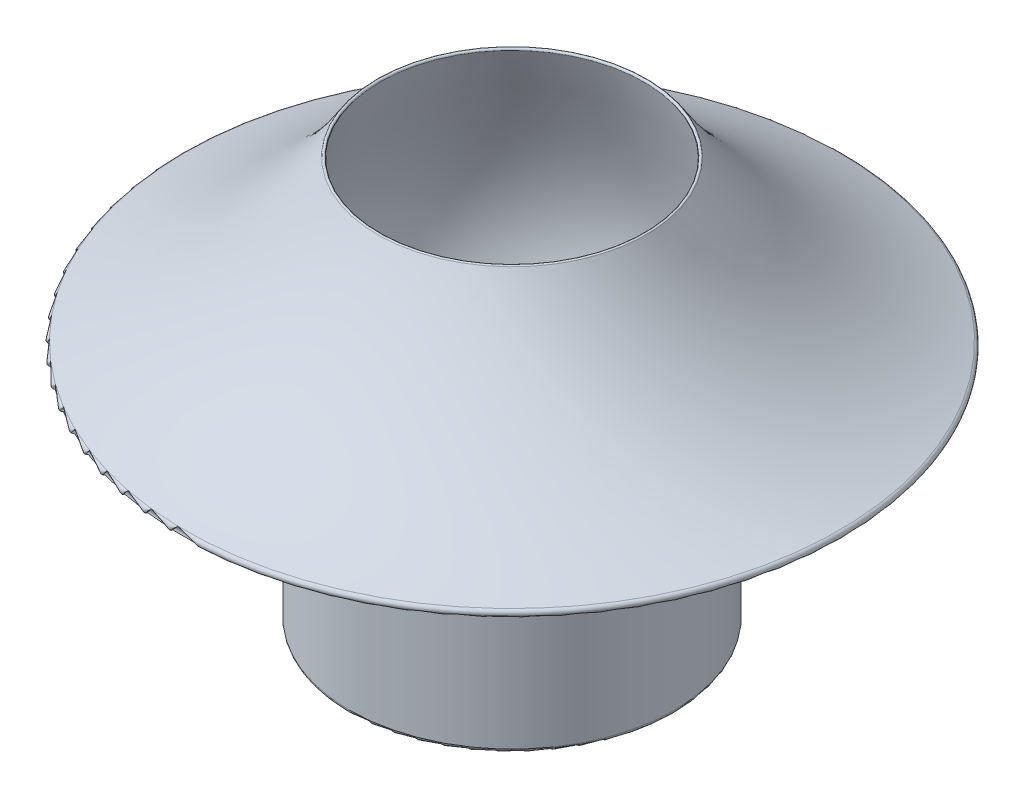
ISO-10303-21;
HEADER;
FILE_DESCRIPTION(('STEP AP214'),'2;1');
FILE_NAME('part.step','',(''),(''),'','','');
FILE_SCHEMA(('AUTOMOTIVE_DESIGN { 1 0 10303 214 1 1 1 1 }'));
ENDSEC;
DATA;
#1=APPLICATION_CONTEXT('core data for automotive mechanical design processes');
#2=APPLICATION_PROTOCOL_DEFINITION('international standard','automotive_design',2000,#1);
#3=PRODUCT_CONTEXT('',#1,'mechanical');
#4=PRODUCT('Part','Part','',(#3));
#5=PRODUCT_RELATED_PRODUCT_CATEGORY('part','',(#4));
#6=PRODUCT_DEFINITION_FORMATION('','',#4);
#7=PRODUCT_DEFINITION_CONTEXT('part definition',#1,'design');
#8=PRODUCT_DEFINITION('design','',#6,#7);
#9=PRODUCT_DEFINITION_SHAPE('','',#8);
#10=(LENGTH_UNIT() NAMED_UNIT(*) SI_UNIT(.MILLI.,.METRE.));
#11=(NAMED_UNIT(*) PLANE_ANGLE_UNIT() SI_UNIT($,.RADIAN.));
#12=(NAMED_UNIT(*) SI_UNIT($,.STERADIAN.) SOLID_ANGLE_UNIT());
#13=UNCERTAINTY_MEASURE_WITH_UNIT(LENGTH_MEASURE(1.E-05),#10,'distance_accuracy_value','');
#14=(GEOMETRIC_REPRESENTATION_CONTEXT(3) GLOBAL_UNCERTAINTY_ASSIGNED_CONTEXT((#13)) GLOBAL_UNIT_ASSIGNED_CONTEXT((#10,
#11,#12)) REPRESENTATION_CONTEXT('',''));
#15=CARTESIAN_POINT('',(0.,0.,0.));
#16=DIRECTION('',(0.,0.,1.));
#17=DIRECTION('',(1.,0.,0.));
#18=AXIS2_PLACEMENT_3D('',#15,#16,#17);
#19=CARTESIAN_POINT('',(-9.4,0.,0.));
#20=CARTESIAN_POINT('',(-9.33948597216466,4.84657774379016,0.));
#21=CARTESIAN_POINT('',(-9.33238520559473,5.66205795557004,0.));
#22=CARTESIAN_POINT('',(-9.3826600404896,9.93484360617857,0.));
#23=CARTESIAN_POINT('',(-12.7943838867771,16.5906599900294,0.));
#24=CARTESIAN_POINT('',(-9.68133208366127,22.7310987063358,0.));
#25=CARTESIAN_POINT('',(-8.5,27.2,0.));
#26=B_SPLINE_CURVE_WITH_KNOTS('',3,(#19,#20,#21,#22,#23,#24,#25),.UNSPECIFIED.,.F.,.F.,(4,1,1,1,
4),(0.,0.339183226100984,0.391163003284907,0.51979777183923,1.),.UNSPECIFIED.);
#27=CARTESIAN_POINT('',(0.,27.2,0.));
#28=DIRECTION('',(0.,1.,0.));
#29=AXIS1_PLACEMENT('',#27,#28);
#30=SURFACE_OF_REVOLUTION('',#26,#29);
#31=CARTESIAN_POINT('',(0.,26.4553874509103,0.));
#32=DIRECTION('',(0.,1.,0.));
#33=DIRECTION('',(-1.,0.,0.));
#34=AXIS2_PLACEMENT_3D('',#31,#32,#33);
#35=CIRCLE('',#34,8.70675476761947);
#36=CARTESIAN_POINT('',(-8.70675476761947,26.4553874509103,0.));
#37=VERTEX_POINT('',#36);
#38=EDGE_CURVE('E60',#37,#37,#35,.T.);
#39=ORIENTED_EDGE('',*,*,#38,.T.);
#40=EDGE_LOOP('',(#39));
#41=FACE_BOUND('',#40,.T.);
#42=CARTESIAN_POINT('',(0.,0.,0.));
#43=DIRECTION('',(0.,1.,0.));
#44=DIRECTION('',(-1.,0.,0.));
#45=AXIS2_PLACEMENT_3D('',#42,#43,#44);
#46=CIRCLE('',#45,9.4);
#47=CARTESIAN_POINT('',(-9.4,0.,0.));
#48=VERTEX_POINT('',#47);
#49=EDGE_CURVE('E69',#48,#48,#46,.T.);
#50=ORIENTED_EDGE('',*,*,#49,.F.);
#51=EDGE_LOOP('',(#50));
#52=FACE_BOUND('',#51,.T.);
#53=ADVANCED_FACE('F31',(#41,#52),#30,.F.);
#54=CARTESIAN_POINT('',(0.,39.5768378294714,0.));
#55=DIRECTION('',(0.,1.,0.));
#56=DIRECTION('',(-1.,0.,0.));
#57=AXIS2_PLACEMENT_3D('',#54,#55,#56);
#58=TOROIDAL_SURFACE('',#57,30.4571725934355,25.2052284844821);
#59=CARTESIAN_POINT('',(0.,15.9840073066325,0.));
#60=DIRECTION('',(0.,1.,0.));
#61=DIRECTION('',(-1.,0.,0.));
#62=AXIS2_PLACEMENT_3D('',#59,#60,#61);
#63=CIRCLE('',#62,21.5868912633113);
#64=CARTESIAN_POINT('',(-21.5868912633113,15.9840073066325,0.));
#65=VERTEX_POINT('',#64);
#66=EDGE_CURVE('E38',#65,#65,#63,.T.);
#67=ORIENTED_EDGE('',*,*,#66,.T.);
#68=EDGE_LOOP('',(#67));
#69=FACE_BOUND('',#68,.T.);
#70=CARTESIAN_POINT('',(0.,26.5349585195775,0.));
#71=DIRECTION('',(0.,1.,0.));
#72=DIRECTION('',(-1.,0.,0.));
#73=AXIS2_PLACEMENT_3D('',#70,#71,#72);
#74=CIRCLE('',#73,8.88837737856289);
#75=CARTESIAN_POINT('',(-8.88837737856289,26.5349585195775,0.));
#76=VERTEX_POINT('',#75);
#77=EDGE_CURVE('E57',#76,#76,#74,.F.);
#78=ORIENTED_EDGE('',*,*,#77,.T.);
#79=EDGE_LOOP('',(#78));
#80=FACE_BOUND('',#79,.T.);
#81=ADVANCED_FACE('F82',(#69,#80),#58,.F.);
#82=CARTESIAN_POINT('',(-14.8,15.5,0.));
#83=DIRECTION('',(0.,-1.,0.));
#84=DIRECTION('',(1.,0.,0.));
#85=AXIS2_PLACEMENT_3D('',#82,#83,#84);
#86=PLANE('',#85);
#87=CARTESIAN_POINT('',(0.,15.5,0.));
#88=DIRECTION('',(0.,-1.,0.));
#89=DIRECTION('',(1.,0.,0.));
#90=AXIS2_PLACEMENT_3D('',#87,#88,#89);
#91=CIRCLE('',#90,21.4989106947599);
#92=CARTESIAN_POINT('',(21.4989106947599,15.5,0.));
#93=VERTEX_POINT('',#92);
#94=EDGE_CURVE('E10',#93,#93,#91,.T.);
#95=ORIENTED_EDGE('',*,*,#94,.T.);
#96=EDGE_LOOP('',(#95));
#97=FACE_BOUND('',#96,.T.);
#98=CARTESIAN_POINT('',(0.,15.5,0.));
#99=DIRECTION('',(0.,1.,0.));
#100=DIRECTION('',(-1.,0.,0.));
#101=AXIS2_PLACEMENT_3D('',#98,#99,#100);
#102=CIRCLE('',#101,14.8);
#103=CARTESIAN_POINT('',(-14.8,15.5,0.));
#104=VERTEX_POINT('',#103);
#105=EDGE_CURVE('E63',#104,#104,#102,.T.);
#106=ORIENTED_EDGE('',*,*,#105,.T.);
#107=EDGE_LOOP('',(#106));
#108=FACE_BOUND('',#107,.T.);
#109=ADVANCED_FACE('F118',(#97,#108),#86,.T.);
#110=CARTESIAN_POINT('',(0.,27.2,0.));
#111=DIRECTION('',(0.,1.,0.));
#112=DIRECTION('',(-1.,0.,0.));
#113=AXIS2_PLACEMENT_3D('',#110,#111,#112);
#114=CYLINDRICAL_SURFACE('',#113,14.8);
#115=CARTESIAN_POINT('',(0.,10.85,0.));
#116=DIRECTION('',(0.,-1.,0.));
#117=DIRECTION('',(1.,0.,0.));
#118=AXIS2_PLACEMENT_3D('',#115,#116,#117);
#119=CIRCLE('',#118,14.8);
#120=CARTESIAN_POINT('',(14.8,10.85,0.));
#121=VERTEX_POINT('',#120);
#122=EDGE_CURVE('E54',#121,#121,#119,.F.);
#123=ORIENTED_EDGE('',*,*,#122,.T.);
#124=EDGE_LOOP('',(#123));
#125=FACE_BOUND('',#124,.T.);
#126=ORIENTED_EDGE('',*,*,#105,.F.);
#127=EDGE_LOOP('',(#126));
#128=FACE_BOUND('',#127,.T.);
#129=ADVANCED_FACE('F112',(#125,#128),#114,.T.);
#130=CARTESIAN_POINT('',(-10.7,10.6,0.));
#131=DIRECTION('',(0.,-1.,0.));
#132=DIRECTION('',(1.,0.,0.));
#133=AXIS2_PLACEMENT_3D('',#130,#131,#132);
#134=PLANE('',#133);
#135=CARTESIAN_POINT('',(0.,10.6,0.));
#136=DIRECTION('',(0.,-1.,0.));
#137=DIRECTION('',(1.,0.,0.));
#138=AXIS2_PLACEMENT_3D('',#135,#136,#137);
#139=CIRCLE('',#138,14.55);
#140=CARTESIAN_POINT('',(14.55,10.6,0.));
#141=VERTEX_POINT('',#140);
#142=EDGE_CURVE('E51',#141,#141,#139,.T.);
#143=ORIENTED_EDGE('',*,*,#142,.T.);
#144=EDGE_LOOP('',(#143));
#145=FACE_BOUND('',#144,.T.);
#146=CARTESIAN_POINT('',(0.,10.6,0.));
#147=DIRECTION('',(0.,1.,0.));
#148=DIRECTION('',(-1.,0.,0.));
#149=AXIS2_PLACEMENT_3D('',#146,#147,#148);
#150=CIRCLE('',#149,10.7);
#151=CARTESIAN_POINT('',(-10.7,10.6,0.));
#152=VERTEX_POINT('',#151);
#153=EDGE_CURVE('E66',#152,#152,#150,.T.);
#154=ORIENTED_EDGE('',*,*,#153,.T.);
#155=EDGE_LOOP('',(#154));
#156=FACE_BOUND('',#155,.T.);
#157=ADVANCED_FACE('F107',(#145,#156),#134,.T.);
#158=CARTESIAN_POINT('',(0.,27.2,0.));
#159=DIRECTION('',(0.,1.,0.));
#160=DIRECTION('',(-1.,0.,0.));
#161=AXIS2_PLACEMENT_3D('',#158,#159,#160);
#162=CYLINDRICAL_SURFACE('',#161,10.7);
#163=CARTESIAN_POINT('',(0.,0.25,0.));
#164=DIRECTION('',(0.,-1.,0.));
#165=DIRECTION('',(1.,0.,0.));
#166=AXIS2_PLACEMENT_3D('',#163,#164,#165);
#167=CIRCLE('',#166,10.7);
#168=CARTESIAN_POINT('',(10.7,0.250000000000001,0.));
#169=VERTEX_POINT('',#168);
#170=EDGE_CURVE('E46',#169,#169,#167,.F.);
#171=ORIENTED_EDGE('',*,*,#170,.T.);
#172=EDGE_LOOP('',(#171));
#173=FACE_BOUND('',#172,.T.);
#174=ORIENTED_EDGE('',*,*,#153,.F.);
#175=EDGE_LOOP('',(#174));
#176=FACE_BOUND('',#175,.T.);
#177=ADVANCED_FACE('F104',(#173,#176),#162,.T.);
#178=CARTESIAN_POINT('',(-9.4,0.,0.));
#179=DIRECTION('',(0.,-1.,0.));
#180=DIRECTION('',(1.,0.,0.));
#181=AXIS2_PLACEMENT_3D('',#178,#179,#180);
#182=PLANE('',#181);
#183=CARTESIAN_POINT('',(0.,0.,0.));
#184=DIRECTION('',(0.,-1.,0.));
#185=DIRECTION('',(1.,0.,0.));
#186=AXIS2_PLACEMENT_3D('',#183,#184,#185);
#187=CIRCLE('',#186,10.45);
#188=CARTESIAN_POINT('',(10.45,0.,0.));
#189=VERTEX_POINT('',#188);
#190=EDGE_CURVE('E42',#189,#189,#187,.T.);
#191=ORIENTED_EDGE('',*,*,#190,.T.);
#192=EDGE_LOOP('',(#191));
#193=FACE_BOUND('',#192,.T.);
#194=ORIENTED_EDGE('',*,*,#49,.T.);
#195=EDGE_LOOP('',(#194));
#196=FACE_BOUND('',#195,.T.);
#197=ADVANCED_FACE('F89',(#193,#196),#182,.T.);
#198=CARTESIAN_POINT('',(0.,26.4832157658154,0.));
#199=DIRECTION('',(0.,-1.,0.));
#200=DIRECTION('',(1.,0.,0.));
#201=AXIS2_PLACEMENT_3D('',#198,#199,#200);
#202=TOROIDAL_SURFACE('',#201,8.80280467594614,0.1);
#203=ORIENTED_EDGE('',*,*,#77,.F.);
#204=EDGE_LOOP('',(#203));
#205=FACE_BOUND('',#204,.T.);
#206=ORIENTED_EDGE('',*,*,#38,.F.);
#207=EDGE_LOOP('',(#206));
#208=FACE_BOUND('',#207,.T.);
#209=ADVANCED_FACE('F85',(#205,#208),#202,.T.);
#210=CARTESIAN_POINT('',(0.,10.85,0.));
#211=DIRECTION('',(0.,-1.,0.));
#212=DIRECTION('',(1.,0.,0.));
#213=AXIS2_PLACEMENT_3D('',#210,#211,#212);
#214=TOROIDAL_SURFACE('',#213,14.55,0.25);
#215=ORIENTED_EDGE('',*,*,#142,.F.);
#216=EDGE_LOOP('',(#215));
#217=FACE_BOUND('',#216,.T.);
#218=ORIENTED_EDGE('',*,*,#122,.F.);
#219=EDGE_LOOP('',(#218));
#220=FACE_BOUND('',#219,.T.);
#221=ADVANCED_FACE('F88',(#217,#220),#214,.T.);
#222=CARTESIAN_POINT('',(0.,0.25,0.));
#223=DIRECTION('',(0.,-1.,0.));
#224=DIRECTION('',(1.,0.,0.));
#225=AXIS2_PLACEMENT_3D('',#222,#223,#224);
#226=TOROIDAL_SURFACE('',#225,10.45,0.25);
#227=ORIENTED_EDGE('',*,*,#190,.F.);
#228=EDGE_LOOP('',(#227));
#229=FACE_BOUND('',#228,.T.);
#230=ORIENTED_EDGE('',*,*,#170,.F.);
#231=EDGE_LOOP('',(#230));
#232=FACE_BOUND('',#231,.T.);
#233=ADVANCED_FACE('F92',(#229,#232),#226,.T.);
#234=CARTESIAN_POINT('',(0.,15.75,0.));
#235=DIRECTION('',(0.,1.,0.));
#236=DIRECTION('',(-1.,0.,0.));
#237=AXIS2_PLACEMENT_3D('',#234,#235,#236);
#238=TOROIDAL_SURFACE('',#237,21.4989106947599,0.25);
#239=ORIENTED_EDGE('',*,*,#94,.F.);
#240=EDGE_LOOP('',(#239));
#241=FACE_BOUND('',#240,.T.);
#242=ORIENTED_EDGE('',*,*,#66,.F.);
#243=EDGE_LOOP('',(#242));
#244=FACE_BOUND('',#243,.T.);
#245=ADVANCED_FACE('F33',(#241,#244),#238,.T.);
#246=CLOSED_SHELL('',(#53,#81,#109,#129,#157,#177,#197,#209,#221,#233,#245));
#247=MANIFOLD_SOLID_BREP('B2',#246);
#248=ADVANCED_BREP_SHAPE_REPRESENTATION('',(#18,#247),#14);
#249=SHAPE_DEFINITION_REPRESENTATION(#9,#248);
ENDSEC;
END-ISO-10303-21;
